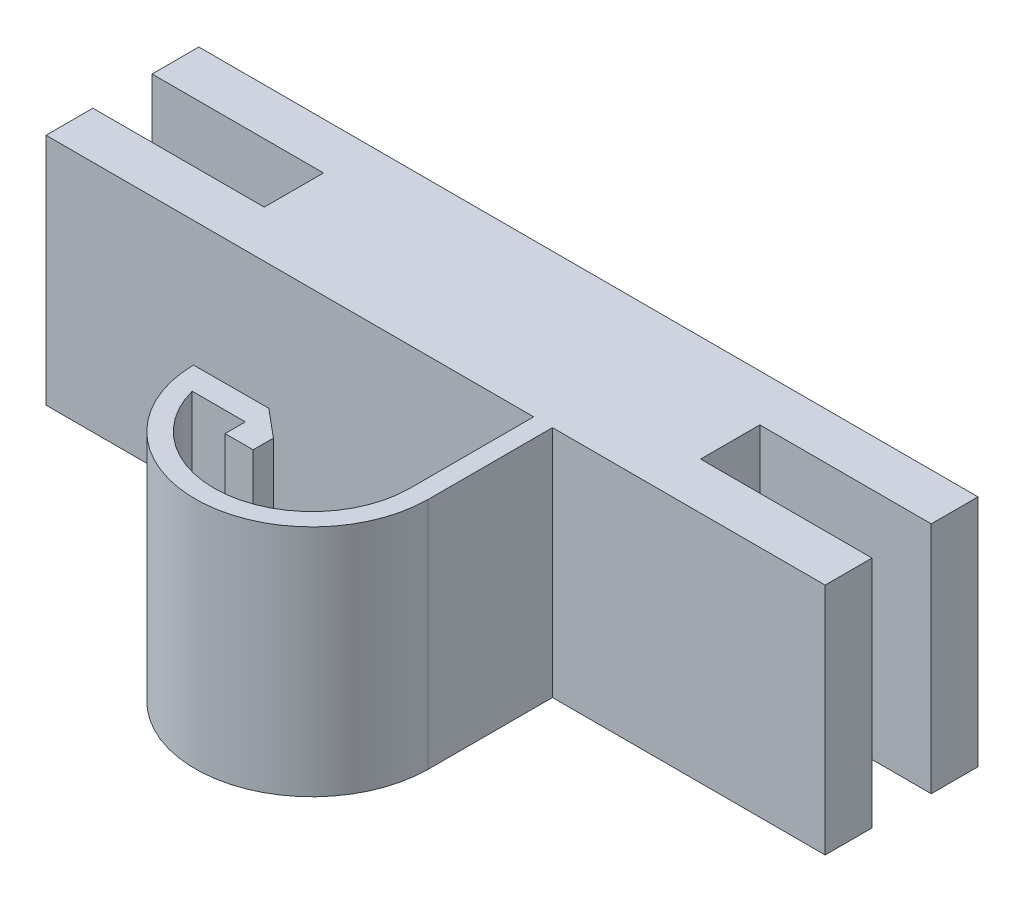
ISO-10303-21;
HEADER;
FILE_DESCRIPTION(('STEP AP214'),'2;1');
FILE_NAME('part.step','',(''),(''),'','','');
FILE_SCHEMA(('AUTOMOTIVE_DESIGN { 1 0 10303 214 1 1 1 1 }'));
ENDSEC;
DATA;
#1=APPLICATION_CONTEXT('core data for automotive mechanical design processes');
#2=APPLICATION_PROTOCOL_DEFINITION('international standard','automotive_design',2000,#1);
#3=PRODUCT_CONTEXT('',#1,'mechanical');
#4=PRODUCT('Part','Part','',(#3));
#5=PRODUCT_RELATED_PRODUCT_CATEGORY('part','',(#4));
#6=PRODUCT_DEFINITION_FORMATION('','',#4);
#7=PRODUCT_DEFINITION_CONTEXT('part definition',#1,'design');
#8=PRODUCT_DEFINITION('design','',#6,#7);
#9=PRODUCT_DEFINITION_SHAPE('','',#8);
#10=(LENGTH_UNIT() NAMED_UNIT(*) SI_UNIT(.MILLI.,.METRE.));
#11=(NAMED_UNIT(*) PLANE_ANGLE_UNIT() SI_UNIT($,.RADIAN.));
#12=(NAMED_UNIT(*) SI_UNIT($,.STERADIAN.) SOLID_ANGLE_UNIT());
#13=UNCERTAINTY_MEASURE_WITH_UNIT(LENGTH_MEASURE(1.E-05),#10,'distance_accuracy_value','');
#14=(GEOMETRIC_REPRESENTATION_CONTEXT(3) GLOBAL_UNCERTAINTY_ASSIGNED_CONTEXT((#13)) GLOBAL_UNIT_ASSIGNED_CONTEXT((#10,
#11,#12)) REPRESENTATION_CONTEXT('',''));
#15=CARTESIAN_POINT('',(0.,0.,0.));
#16=DIRECTION('',(0.,0.,1.));
#17=DIRECTION('',(1.,0.,0.));
#18=AXIS2_PLACEMENT_3D('',#15,#16,#17);
#19=CARTESIAN_POINT('',(-28.3494946045054,15.,-28.7641366865449));
#20=DIRECTION('',(1.,0.,0.));
#21=DIRECTION('',(0.,0.,-1.));
#22=AXIS2_PLACEMENT_3D('',#19,#20,#21);
#23=PLANE('',#22);
#24=DIRECTION('',(0.,0.,1.));
#25=VECTOR('',#24,1.);
#26=CARTESIAN_POINT('',(-28.3494946045054,0.,-28.7641366865449));
#27=LINE('',#26,#25);
#28=CARTESIAN_POINT('',(-28.3494946045054,0.,-28.7641366865449));
#29=VERTEX_POINT('',#28);
#30=CARTESIAN_POINT('',(-28.3494946045054,0.,-25.7641366865449));
#31=VERTEX_POINT('',#30);
#32=EDGE_CURVE('E219',#29,#31,#27,.T.);
#33=ORIENTED_EDGE('',*,*,#32,.T.);
#34=DIRECTION('',(0.,-1.,0.));
#35=VECTOR('',#34,1.);
#36=CARTESIAN_POINT('',(-28.3494946045054,15.,-25.7641366865449));
#37=LINE('',#36,#35);
#38=CARTESIAN_POINT('',(-28.3494946045054,15.,-25.7641366865449));
#39=VERTEX_POINT('',#38);
#40=EDGE_CURVE('E11',#39,#31,#37,.T.);
#41=ORIENTED_EDGE('',*,*,#40,.F.);
#42=DIRECTION('',(0.,0.,1.));
#43=VECTOR('',#42,1.);
#44=CARTESIAN_POINT('',(-28.3494946045054,15.,-28.7641366865449));
#45=LINE('',#44,#43);
#46=CARTESIAN_POINT('',(-28.3494946045054,15.,-28.7641366865449));
#47=VERTEX_POINT('',#46);
#48=EDGE_CURVE('E263',#47,#39,#45,.T.);
#49=ORIENTED_EDGE('',*,*,#48,.F.);
#50=DIRECTION('',(0.,-1.,0.));
#51=VECTOR('',#50,1.);
#52=CARTESIAN_POINT('',(-28.3494946045054,15.,-28.7641366865449));
#53=LINE('',#52,#51);
#54=EDGE_CURVE('E215',#47,#29,#53,.T.);
#55=ORIENTED_EDGE('',*,*,#54,.T.);
#56=EDGE_LOOP('',(#33,#41,#49,#55));
#57=FACE_BOUND('',#56,.T.);
#58=ADVANCED_FACE('F33',(#57),#23,.F.);
#59=CARTESIAN_POINT('',(-28.3494946045054,15.,-25.7641366865449));
#60=DIRECTION('',(0.,0.,-1.));
#61=DIRECTION('',(-1.,0.,0.));
#62=AXIS2_PLACEMENT_3D('',#59,#60,#61);
#63=PLANE('',#62);
#64=DIRECTION('',(1.,0.,0.));
#65=VECTOR('',#64,1.);
#66=CARTESIAN_POINT('',(-28.3494946045054,0.,-25.7641366865449));
#67=LINE('',#66,#65);
#68=CARTESIAN_POINT('',(-17.3494946045054,0.,-25.7641366865449));
#69=VERTEX_POINT('',#68);
#70=EDGE_CURVE('E222',#31,#69,#67,.T.);
#71=ORIENTED_EDGE('',*,*,#70,.T.);
#72=DIRECTION('',(0.,-1.,0.));
#73=VECTOR('',#72,1.);
#74=CARTESIAN_POINT('',(-17.3494946045054,15.,-25.7641366865449));
#75=LINE('',#74,#73);
#76=CARTESIAN_POINT('',(-17.3494946045054,15.,-25.7641366865449));
#77=VERTEX_POINT('',#76);
#78=EDGE_CURVE('E41',#77,#69,#75,.T.);
#79=ORIENTED_EDGE('',*,*,#78,.F.);
#80=DIRECTION('',(1.,0.,0.));
#81=VECTOR('',#80,1.);
#82=CARTESIAN_POINT('',(-28.3494946045054,15.,-25.7641366865449));
#83=LINE('',#82,#81);
#84=EDGE_CURVE('E137',#39,#77,#83,.T.);
#85=ORIENTED_EDGE('',*,*,#84,.F.);
#86=ORIENTED_EDGE('',*,*,#40,.T.);
#87=EDGE_LOOP('',(#71,#79,#85,#86));
#88=FACE_BOUND('',#87,.T.);
#89=ADVANCED_FACE('F396',(#88),#63,.F.);
#90=CARTESIAN_POINT('',(-17.3494946045054,15.,-25.7641366865449));
#91=DIRECTION('',(1.,0.,0.));
#92=DIRECTION('',(0.,0.,-1.));
#93=AXIS2_PLACEMENT_3D('',#90,#91,#92);
#94=PLANE('',#93);
#95=DIRECTION('',(0.,0.,1.));
#96=VECTOR('',#95,1.);
#97=CARTESIAN_POINT('',(-17.3494946045054,0.,-25.7641366865449));
#98=LINE('',#97,#96);
#99=CARTESIAN_POINT('',(-17.3494946045054,0.,-21.9641366865449));
#100=VERTEX_POINT('',#99);
#101=EDGE_CURVE('E224',#69,#100,#98,.T.);
#102=ORIENTED_EDGE('',*,*,#101,.T.);
#103=DIRECTION('',(0.,-1.,0.));
#104=VECTOR('',#103,1.);
#105=CARTESIAN_POINT('',(-17.3494946045054,15.,-21.9641366865449));
#106=LINE('',#105,#104);
#107=CARTESIAN_POINT('',(-17.3494946045054,15.,-21.9641366865449));
#108=VERTEX_POINT('',#107);
#109=EDGE_CURVE('E315',#108,#100,#106,.T.);
#110=ORIENTED_EDGE('',*,*,#109,.F.);
#111=DIRECTION('',(0.,0.,1.));
#112=VECTOR('',#111,1.);
#113=CARTESIAN_POINT('',(-17.3494946045054,15.,-25.7641366865449));
#114=LINE('',#113,#112);
#115=EDGE_CURVE('E323',#77,#108,#114,.T.);
#116=ORIENTED_EDGE('',*,*,#115,.F.);
#117=ORIENTED_EDGE('',*,*,#78,.T.);
#118=EDGE_LOOP('',(#102,#110,#116,#117));
#119=FACE_BOUND('',#118,.T.);
#120=ADVANCED_FACE('F321',(#119),#94,.F.);
#121=CARTESIAN_POINT('',(-28.3494946045054,15.,-21.9641366865449));
#122=DIRECTION('',(0.,0.,1.));
#123=DIRECTION('',(1.,0.,0.));
#124=AXIS2_PLACEMENT_3D('',#121,#122,#123);
#125=PLANE('',#124);
#126=DIRECTION('',(-1.,0.,0.));
#127=VECTOR('',#126,1.);
#128=CARTESIAN_POINT('',(-28.3494946045054,0.,-21.9641366865449));
#129=LINE('',#128,#127);
#130=CARTESIAN_POINT('',(-28.3494946045054,0.,-21.9641366865449));
#131=VERTEX_POINT('',#130);
#132=EDGE_CURVE('E226',#100,#131,#129,.T.);
#133=ORIENTED_EDGE('',*,*,#132,.T.);
#134=DIRECTION('',(0.,-1.,0.));
#135=VECTOR('',#134,1.);
#136=CARTESIAN_POINT('',(-28.3494946045054,15.,-21.9641366865449));
#137=LINE('',#136,#135);
#138=CARTESIAN_POINT('',(-28.3494946045054,15.,-21.9641366865449));
#139=VERTEX_POINT('',#138);
#140=EDGE_CURVE('E312',#139,#131,#137,.T.);
#141=ORIENTED_EDGE('',*,*,#140,.F.);
#142=DIRECTION('',(-1.,0.,0.));
#143=VECTOR('',#142,1.);
#144=CARTESIAN_POINT('',(-28.3494946045054,15.,-21.9641366865449));
#145=LINE('',#144,#143);
#146=EDGE_CURVE('E341',#108,#139,#145,.T.);
#147=ORIENTED_EDGE('',*,*,#146,.F.);
#148=ORIENTED_EDGE('',*,*,#109,.T.);
#149=EDGE_LOOP('',(#133,#141,#147,#148));
#150=FACE_BOUND('',#149,.T.);
#151=ADVANCED_FACE('F332',(#150),#125,.F.);
#152=CARTESIAN_POINT('',(-28.3494946045054,15.,-21.9641366865449));
#153=DIRECTION('',(1.,0.,0.));
#154=DIRECTION('',(0.,0.,-1.));
#155=AXIS2_PLACEMENT_3D('',#152,#153,#154);
#156=PLANE('',#155);
#157=DIRECTION('',(0.,0.,1.));
#158=VECTOR('',#157,1.);
#159=CARTESIAN_POINT('',(-28.3494946045054,0.,-21.9641366865449));
#160=LINE('',#159,#158);
#161=CARTESIAN_POINT('',(-28.3494946045054,0.,-18.957031621231));
#162=VERTEX_POINT('',#161);
#163=EDGE_CURVE('E228',#131,#162,#160,.T.);
#164=ORIENTED_EDGE('',*,*,#163,.T.);
#165=DIRECTION('',(0.,-1.,0.));
#166=VECTOR('',#165,1.);
#167=CARTESIAN_POINT('',(-28.3494946045054,15.,-18.957031621231));
#168=LINE('',#167,#166);
#169=CARTESIAN_POINT('',(-28.3494946045054,15.,-18.957031621231));
#170=VERTEX_POINT('',#169);
#171=EDGE_CURVE('E309',#170,#162,#168,.T.);
#172=ORIENTED_EDGE('',*,*,#171,.F.);
#173=DIRECTION('',(0.,0.,1.));
#174=VECTOR('',#173,1.);
#175=CARTESIAN_POINT('',(-28.3494946045054,15.,-21.9641366865449));
#176=LINE('',#175,#174);
#177=EDGE_CURVE('E338',#139,#170,#176,.T.);
#178=ORIENTED_EDGE('',*,*,#177,.F.);
#179=ORIENTED_EDGE('',*,*,#140,.T.);
#180=EDGE_LOOP('',(#164,#172,#178,#179));
#181=FACE_BOUND('',#180,.T.);
#182=ADVANCED_FACE('F336',(#181),#156,.F.);
#183=CARTESIAN_POINT('',(-28.3494946045054,15.,-18.957031621231));
#184=DIRECTION('',(0.,0.,-1.));
#185=DIRECTION('',(-1.,0.,0.));
#186=AXIS2_PLACEMENT_3D('',#183,#184,#185);
#187=PLANE('',#186);
#188=DIRECTION('',(1.,0.,0.));
#189=VECTOR('',#188,1.);
#190=CARTESIAN_POINT('',(-28.3494946045054,0.,-18.957031621231));
#191=LINE('',#190,#189);
#192=CARTESIAN_POINT('',(2.94781302884944,0.,-18.957031621231));
#193=VERTEX_POINT('',#192);
#194=EDGE_CURVE('E230',#162,#193,#191,.T.);
#195=ORIENTED_EDGE('',*,*,#194,.T.);
#196=DIRECTION('',(0.,-1.,0.));
#197=VECTOR('',#196,1.);
#198=CARTESIAN_POINT('',(2.94781302884944,15.,-18.957031621231));
#199=LINE('',#198,#197);
#200=CARTESIAN_POINT('',(2.94781302884944,15.,-18.957031621231));
#201=VERTEX_POINT('',#200);
#202=EDGE_CURVE('E306',#201,#193,#199,.T.);
#203=ORIENTED_EDGE('',*,*,#202,.F.);
#204=DIRECTION('',(1.,0.,0.));
#205=VECTOR('',#204,1.);
#206=CARTESIAN_POINT('',(-28.3494946045054,15.,-18.957031621231));
#207=LINE('',#206,#205);
#208=EDGE_CURVE('E340',#170,#201,#207,.T.);
#209=ORIENTED_EDGE('',*,*,#208,.F.);
#210=ORIENTED_EDGE('',*,*,#171,.T.);
#211=EDGE_LOOP('',(#195,#203,#209,#210));
#212=FACE_BOUND('',#211,.T.);
#213=ADVANCED_FACE('F409',(#212),#187,.F.);
#214=CARTESIAN_POINT('',(2.94781302884944,15.,-10.957031621231));
#215=DIRECTION('',(1.,0.,0.));
#216=DIRECTION('',(0.,0.,-1.));
#217=AXIS2_PLACEMENT_3D('',#214,#215,#216);
#218=PLANE('',#217);
#219=DIRECTION('',(0.,0.,1.));
#220=VECTOR('',#219,1.);
#221=CARTESIAN_POINT('',(2.94781302884944,0.,-10.957031621231));
#222=LINE('',#221,#220);
#223=CARTESIAN_POINT('',(2.94781302884944,0.,-10.957031621231));
#224=VERTEX_POINT('',#223);
#225=EDGE_CURVE('E232',#193,#224,#222,.T.);
#226=ORIENTED_EDGE('',*,*,#225,.T.);
#227=DIRECTION('',(0.,-1.,0.));
#228=VECTOR('',#227,1.);
#229=CARTESIAN_POINT('',(2.94781302884944,15.,-10.957031621231));
#230=LINE('',#229,#228);
#231=CARTESIAN_POINT('',(2.94781302884944,15.,-10.957031621231));
#232=VERTEX_POINT('',#231);
#233=EDGE_CURVE('E303',#232,#224,#230,.T.);
#234=ORIENTED_EDGE('',*,*,#233,.F.);
#235=DIRECTION('',(0.,0.,1.));
#236=VECTOR('',#235,1.);
#237=CARTESIAN_POINT('',(2.94781302884944,15.,-10.957031621231));
#238=LINE('',#237,#236);
#239=EDGE_CURVE('E343',#201,#232,#238,.T.);
#240=ORIENTED_EDGE('',*,*,#239,.F.);
#241=ORIENTED_EDGE('',*,*,#202,.T.);
#242=EDGE_LOOP('',(#226,#234,#240,#241));
#243=FACE_BOUND('',#242,.T.);
#244=ADVANCED_FACE('F412',(#243),#218,.F.);
#245=CARTESIAN_POINT('',(-3.34884776816842,15.,-11.0291567802373));
#246=DIRECTION('',(0.,-1.,0.));
#247=DIRECTION('',(0.,0.,-1.));
#248=AXIS2_PLACEMENT_3D('',#245,#246,#247);
#249=CYLINDRICAL_SURFACE('',#248,6.29707386261772);
#250=CARTESIAN_POINT('',(-3.34884776816842,0.,-11.0291567802373));
#251=DIRECTION('',(0.,-1.,0.));
#252=DIRECTION('',(0.,0.,1.));
#253=AXIS2_PLACEMENT_3D('',#250,#251,#252);
#254=CIRCLE('',#253,6.29707386261772);
#255=CARTESIAN_POINT('',(-9.43771436646013,0.,-9.42327920723522));
#256=VERTEX_POINT('',#255);
#257=EDGE_CURVE('E234',#224,#256,#254,.T.);
#258=ORIENTED_EDGE('',*,*,#257,.T.);
#259=DIRECTION('',(0.,-1.,0.));
#260=VECTOR('',#259,1.);
#261=CARTESIAN_POINT('',(-9.43771436646013,15.,-9.42327920723522));
#262=LINE('',#261,#260);
#263=CARTESIAN_POINT('',(-9.43771436646013,15.,-9.42327920723522));
#264=VERTEX_POINT('',#263);
#265=EDGE_CURVE('E300',#264,#256,#262,.T.);
#266=ORIENTED_EDGE('',*,*,#265,.F.);
#267=CARTESIAN_POINT('',(-3.34884776816842,15.,-11.0291567802373));
#268=DIRECTION('',(0.,-1.,0.));
#269=DIRECTION('',(0.,0.,1.));
#270=AXIS2_PLACEMENT_3D('',#267,#268,#269);
#271=CIRCLE('',#270,6.29707386261772);
#272=EDGE_CURVE('E349',#232,#264,#271,.T.);
#273=ORIENTED_EDGE('',*,*,#272,.F.);
#274=ORIENTED_EDGE('',*,*,#233,.T.);
#275=EDGE_LOOP('',(#258,#266,#273,#274));
#276=FACE_BOUND('',#275,.T.);
#277=ADVANCED_FACE('F416',(#276),#249,.F.);
#278=CARTESIAN_POINT('',(-6.02598002729304,15.,-9.42327920723522));
#279=DIRECTION('',(0.,0.,-1.));
#280=DIRECTION('',(-1.,0.,0.));
#281=AXIS2_PLACEMENT_3D('',#278,#279,#280);
#282=PLANE('',#281);
#283=DIRECTION('',(1.,0.,0.));
#284=VECTOR('',#283,1.);
#285=CARTESIAN_POINT('',(-6.02598002729304,0.,-9.42327920723522));
#286=LINE('',#285,#284);
#287=CARTESIAN_POINT('',(-6.02598002729304,0.,-9.42327920723522));
#288=VERTEX_POINT('',#287);
#289=EDGE_CURVE('E236',#256,#288,#286,.T.);
#290=ORIENTED_EDGE('',*,*,#289,.T.);
#291=DIRECTION('',(0.,-1.,0.));
#292=VECTOR('',#291,1.);
#293=CARTESIAN_POINT('',(-6.02598002729304,15.,-9.42327920723522));
#294=LINE('',#293,#292);
#295=CARTESIAN_POINT('',(-6.02598002729304,15.,-9.42327920723522));
#296=VERTEX_POINT('',#295);
#297=EDGE_CURVE('E297',#296,#288,#294,.T.);
#298=ORIENTED_EDGE('',*,*,#297,.F.);
#299=DIRECTION('',(1.,0.,0.));
#300=VECTOR('',#299,1.);
#301=CARTESIAN_POINT('',(-6.02598002729304,15.,-9.42327920723522));
#302=LINE('',#301,#300);
#303=EDGE_CURVE('E351',#264,#296,#302,.T.);
#304=ORIENTED_EDGE('',*,*,#303,.F.);
#305=ORIENTED_EDGE('',*,*,#265,.T.);
#306=EDGE_LOOP('',(#290,#298,#304,#305));
#307=FACE_BOUND('',#306,.T.);
#308=ADVANCED_FACE('F420',(#307),#282,.F.);
#309=CARTESIAN_POINT('',(-6.02598002729304,15.,-8.12221037726084));
#310=DIRECTION('',(1.,0.,0.));
#311=DIRECTION('',(0.,0.,-1.));
#312=AXIS2_PLACEMENT_3D('',#309,#310,#311);
#313=PLANE('',#312);
#314=DIRECTION('',(0.,0.,1.));
#315=VECTOR('',#314,1.);
#316=CARTESIAN_POINT('',(-6.02598002729304,0.,-8.12221037726084));
#317=LINE('',#316,#315);
#318=CARTESIAN_POINT('',(-6.02598002729304,0.,-8.12221037726084));
#319=VERTEX_POINT('',#318);
#320=EDGE_CURVE('E238',#288,#319,#317,.T.);
#321=ORIENTED_EDGE('',*,*,#320,.T.);
#322=DIRECTION('',(0.,-1.,0.));
#323=VECTOR('',#322,1.);
#324=CARTESIAN_POINT('',(-6.02598002729304,15.,-8.12221037726084));
#325=LINE('',#324,#323);
#326=CARTESIAN_POINT('',(-6.02598002729304,15.,-8.12221037726084));
#327=VERTEX_POINT('',#326);
#328=EDGE_CURVE('E294',#327,#319,#325,.T.);
#329=ORIENTED_EDGE('',*,*,#328,.F.);
#330=DIRECTION('',(0.,0.,1.));
#331=VECTOR('',#330,1.);
#332=CARTESIAN_POINT('',(-6.02598002729304,15.,-8.12221037726084));
#333=LINE('',#332,#331);
#334=EDGE_CURVE('E353',#296,#327,#333,.T.);
#335=ORIENTED_EDGE('',*,*,#334,.F.);
#336=ORIENTED_EDGE('',*,*,#297,.T.);
#337=EDGE_LOOP('',(#321,#329,#335,#336));
#338=FACE_BOUND('',#337,.T.);
#339=ADVANCED_FACE('F424',(#338),#313,.F.);
#340=CARTESIAN_POINT('',(-4.22249353495374,15.,-8.12221037726084));
#341=DIRECTION('',(0.,0.,-1.));
#342=DIRECTION('',(-1.,0.,0.));
#343=AXIS2_PLACEMENT_3D('',#340,#341,#342);
#344=PLANE('',#343);
#345=DIRECTION('',(1.,0.,0.));
#346=VECTOR('',#345,1.);
#347=CARTESIAN_POINT('',(-4.22249353495374,0.,-8.12221037726084));
#348=LINE('',#347,#346);
#349=CARTESIAN_POINT('',(-4.22249353495374,0.,-8.12221037726084));
#350=VERTEX_POINT('',#349);
#351=EDGE_CURVE('E240',#319,#350,#348,.T.);
#352=ORIENTED_EDGE('',*,*,#351,.T.);
#353=DIRECTION('',(0.,-1.,0.));
#354=VECTOR('',#353,1.);
#355=CARTESIAN_POINT('',(-4.22249353495374,15.,-8.12221037726084));
#356=LINE('',#355,#354);
#357=CARTESIAN_POINT('',(-4.22249353495374,15.,-8.12221037726084));
#358=VERTEX_POINT('',#357);
#359=EDGE_CURVE('E291',#358,#350,#356,.T.);
#360=ORIENTED_EDGE('',*,*,#359,.F.);
#361=DIRECTION('',(1.,0.,0.));
#362=VECTOR('',#361,1.);
#363=CARTESIAN_POINT('',(-4.22249353495374,15.,-8.12221037726084));
#364=LINE('',#363,#362);
#365=EDGE_CURVE('E355',#327,#358,#364,.T.);
#366=ORIENTED_EDGE('',*,*,#365,.F.);
#367=ORIENTED_EDGE('',*,*,#328,.T.);
#368=EDGE_LOOP('',(#352,#360,#366,#367));
#369=FACE_BOUND('',#368,.T.);
#370=ADVANCED_FACE('F428',(#369),#344,.F.);
#371=CARTESIAN_POINT('',(-4.22249353495374,15.,-9.42322624533869));
#372=DIRECTION('',(-1.,0.,0.));
#373=DIRECTION('',(0.,0.,1.));
#374=AXIS2_PLACEMENT_3D('',#371,#372,#373);
#375=PLANE('',#374);
#376=DIRECTION('',(0.,0.,-1.));
#377=VECTOR('',#376,1.);
#378=CARTESIAN_POINT('',(-4.22249353495374,0.,-9.42322624533869));
#379=LINE('',#378,#377);
#380=CARTESIAN_POINT('',(-4.22249353495374,0.,-9.42322624533869));
#381=VERTEX_POINT('',#380);
#382=EDGE_CURVE('E242',#350,#381,#379,.T.);
#383=ORIENTED_EDGE('',*,*,#382,.T.);
#384=DIRECTION('',(0.,-1.,0.));
#385=VECTOR('',#384,1.);
#386=CARTESIAN_POINT('',(-4.22249353495374,15.,-9.42322624533869));
#387=LINE('',#386,#385);
#388=CARTESIAN_POINT('',(-4.22249353495374,15.,-9.42322624533869));
#389=VERTEX_POINT('',#388);
#390=EDGE_CURVE('E288',#389,#381,#387,.T.);
#391=ORIENTED_EDGE('',*,*,#390,.F.);
#392=DIRECTION('',(0.,0.,-1.));
#393=VECTOR('',#392,1.);
#394=CARTESIAN_POINT('',(-4.22249353495374,15.,-9.42322624533869));
#395=LINE('',#394,#393);
#396=EDGE_CURVE('E357',#358,#389,#395,.T.);
#397=ORIENTED_EDGE('',*,*,#396,.F.);
#398=ORIENTED_EDGE('',*,*,#359,.T.);
#399=EDGE_LOOP('',(#383,#391,#397,#398));
#400=FACE_BOUND('',#399,.T.);
#401=ADVANCED_FACE('F432',(#400),#375,.F.);
#402=CARTESIAN_POINT('',(-6.02618083831885,15.,-10.9323892807032));
#403=DIRECTION('',(-0.641711450833545,0.,0.766946160997698));
#404=DIRECTION('',(0.766946160997698,0.,0.641711450833545));
#405=AXIS2_PLACEMENT_3D('',#402,#403,#404);
#406=PLANE('',#405);
#407=DIRECTION('',(-0.766946160997698,0.,-0.641711450833545));
#408=VECTOR('',#407,1.);
#409=CARTESIAN_POINT('',(-6.02618083831885,0.,-10.9323892807032));
#410=LINE('',#409,#408);
#411=CARTESIAN_POINT('',(-6.02618083831885,0.,-10.9323892807032));
#412=VERTEX_POINT('',#411);
#413=EDGE_CURVE('E244',#381,#412,#410,.T.);
#414=ORIENTED_EDGE('',*,*,#413,.T.);
#415=DIRECTION('',(0.,-1.,0.));
#416=VECTOR('',#415,1.);
#417=CARTESIAN_POINT('',(-6.02618083831885,15.,-10.9323892807032));
#418=LINE('',#417,#416);
#419=CARTESIAN_POINT('',(-6.02618083831885,15.,-10.9323892807032));
#420=VERTEX_POINT('',#419);
#421=EDGE_CURVE('E285',#420,#412,#418,.T.);
#422=ORIENTED_EDGE('',*,*,#421,.F.);
#423=DIRECTION('',(-0.766946160997698,0.,-0.641711450833545));
#424=VECTOR('',#423,1.);
#425=CARTESIAN_POINT('',(-6.02618083831885,15.,-10.9323892807032));
#426=LINE('',#425,#424);
#427=EDGE_CURVE('E359',#389,#420,#426,.T.);
#428=ORIENTED_EDGE('',*,*,#427,.F.);
#429=ORIENTED_EDGE('',*,*,#390,.T.);
#430=EDGE_LOOP('',(#414,#422,#428,#429));
#431=FACE_BOUND('',#430,.T.);
#432=ADVANCED_FACE('F436',(#431),#406,.F.);
#433=CARTESIAN_POINT('',(-10.8477142626421,15.,-10.9173479703678));
#434=DIRECTION('',(0.0031195961577817,0.,0.999995134048067));
#435=DIRECTION('',(0.999995134048068,0.,-0.0031195961577817));
#436=AXIS2_PLACEMENT_3D('',#433,#434,#435);
#437=PLANE('',#436);
#438=DIRECTION('',(-0.999995134048067,0.,0.0031195961577817));
#439=VECTOR('',#438,1.);
#440=CARTESIAN_POINT('',(-10.8477142626421,0.,-10.9173479703678));
#441=LINE('',#440,#439);
#442=CARTESIAN_POINT('',(-10.8477142626421,0.,-10.9173479703678));
#443=VERTEX_POINT('',#442);
#444=EDGE_CURVE('E246',#412,#443,#441,.T.);
#445=ORIENTED_EDGE('',*,*,#444,.T.);
#446=DIRECTION('',(0.,-1.,0.));
#447=VECTOR('',#446,1.);
#448=CARTESIAN_POINT('',(-10.8477142626421,15.,-10.9173479703678));
#449=LINE('',#448,#447);
#450=CARTESIAN_POINT('',(-10.8477142626421,15.,-10.9173479703678));
#451=VERTEX_POINT('',#450);
#452=EDGE_CURVE('E282',#451,#443,#449,.T.);
#453=ORIENTED_EDGE('',*,*,#452,.F.);
#454=DIRECTION('',(-0.999995134048067,0.,0.0031195961577817));
#455=VECTOR('',#454,1.);
#456=CARTESIAN_POINT('',(-10.8477142626421,15.,-10.9173479703678));
#457=LINE('',#456,#455);
#458=EDGE_CURVE('E361',#420,#451,#457,.T.);
#459=ORIENTED_EDGE('',*,*,#458,.F.);
#460=ORIENTED_EDGE('',*,*,#421,.T.);
#461=EDGE_LOOP('',(#445,#453,#459,#460));
#462=FACE_BOUND('',#461,.T.);
#463=ADVANCED_FACE('F440',(#462),#437,.F.);
#464=CARTESIAN_POINT('',(-3.34884776816842,15.,-11.0291567802373));
#465=DIRECTION('',(0.,-1.,0.));
#466=DIRECTION('',(0.,0.,-1.));
#467=AXIS2_PLACEMENT_3D('',#464,#465,#466);
#468=CYLINDRICAL_SURFACE('',#467,7.49969998812645);
#469=CARTESIAN_POINT('',(-3.34884776816842,0.,-11.0291567802373));
#470=DIRECTION('',(0.,1.,0.));
#471=DIRECTION('',(0.,0.,1.));
#472=AXIS2_PLACEMENT_3D('',#469,#470,#471);
#473=CIRCLE('',#472,7.49969998812645);
#474=CARTESIAN_POINT('',(4.15050539549457,0.,-10.957031621231));
#475=VERTEX_POINT('',#474);
#476=EDGE_CURVE('E248',#443,#475,#473,.T.);
#477=ORIENTED_EDGE('',*,*,#476,.T.);
#478=DIRECTION('',(0.,-1.,0.));
#479=VECTOR('',#478,1.);
#480=CARTESIAN_POINT('',(4.15050539549457,15.,-10.957031621231));
#481=LINE('',#480,#479);
#482=CARTESIAN_POINT('',(4.15050539549457,15.,-10.957031621231));
#483=VERTEX_POINT('',#482);
#484=EDGE_CURVE('E279',#483,#475,#481,.T.);
#485=ORIENTED_EDGE('',*,*,#484,.F.);
#486=CARTESIAN_POINT('',(-3.34884776816842,15.,-11.0291567802373));
#487=DIRECTION('',(0.,1.,0.));
#488=DIRECTION('',(0.,0.,1.));
#489=AXIS2_PLACEMENT_3D('',#486,#487,#488);
#490=CIRCLE('',#489,7.49969998812645);
#491=EDGE_CURVE('E363',#451,#483,#490,.T.);
#492=ORIENTED_EDGE('',*,*,#491,.F.);
#493=ORIENTED_EDGE('',*,*,#452,.T.);
#494=EDGE_LOOP('',(#477,#485,#492,#493));
#495=FACE_BOUND('',#494,.T.);
#496=ADVANCED_FACE('F444',(#495),#468,.T.);
#497=CARTESIAN_POINT('',(4.15050539549457,15.,-18.957031621231));
#498=DIRECTION('',(-1.,0.,0.));
#499=DIRECTION('',(0.,0.,1.));
#500=AXIS2_PLACEMENT_3D('',#497,#498,#499);
#501=PLANE('',#500);
#502=DIRECTION('',(0.,0.,-1.));
#503=VECTOR('',#502,1.);
#504=CARTESIAN_POINT('',(4.15050539549457,0.,-18.957031621231));
#505=LINE('',#504,#503);
#506=CARTESIAN_POINT('',(4.15050539549457,0.,-18.957031621231));
#507=VERTEX_POINT('',#506);
#508=EDGE_CURVE('E250',#475,#507,#505,.T.);
#509=ORIENTED_EDGE('',*,*,#508,.T.);
#510=DIRECTION('',(0.,-1.,0.));
#511=VECTOR('',#510,1.);
#512=CARTESIAN_POINT('',(4.15050539549457,15.,-18.957031621231));
#513=LINE('',#512,#511);
#514=CARTESIAN_POINT('',(4.15050539549457,15.,-18.957031621231));
#515=VERTEX_POINT('',#514);
#516=EDGE_CURVE('E276',#515,#507,#513,.T.);
#517=ORIENTED_EDGE('',*,*,#516,.F.);
#518=DIRECTION('',(0.,0.,-1.));
#519=VECTOR('',#518,1.);
#520=CARTESIAN_POINT('',(4.15050539549457,15.,-18.957031621231));
#521=LINE('',#520,#519);
#522=EDGE_CURVE('E365',#483,#515,#521,.T.);
#523=ORIENTED_EDGE('',*,*,#522,.F.);
#524=ORIENTED_EDGE('',*,*,#484,.T.);
#525=EDGE_LOOP('',(#509,#517,#523,#524));
#526=FACE_BOUND('',#525,.T.);
#527=ADVANCED_FACE('F448',(#526),#501,.F.);
#528=CARTESIAN_POINT('',(4.15050539549457,15.,-18.957031621231));
#529=DIRECTION('',(0.,0.,-1.));
#530=DIRECTION('',(-1.,0.,0.));
#531=AXIS2_PLACEMENT_3D('',#528,#529,#530);
#532=PLANE('',#531);
#533=DIRECTION('',(1.,0.,0.));
#534=VECTOR('',#533,1.);
#535=CARTESIAN_POINT('',(4.15050539549457,0.,-18.957031621231));
#536=LINE('',#535,#534);
#537=CARTESIAN_POINT('',(21.6505053954946,0.,-18.957031621231));
#538=VERTEX_POINT('',#537);
#539=EDGE_CURVE('E252',#507,#538,#536,.T.);
#540=ORIENTED_EDGE('',*,*,#539,.T.);
#541=DIRECTION('',(0.,-1.,0.));
#542=VECTOR('',#541,1.);
#543=CARTESIAN_POINT('',(21.6505053954946,15.,-18.957031621231));
#544=LINE('',#543,#542);
#545=CARTESIAN_POINT('',(21.6505053954946,15.,-18.957031621231));
#546=VERTEX_POINT('',#545);
#547=EDGE_CURVE('E273',#546,#538,#544,.T.);
#548=ORIENTED_EDGE('',*,*,#547,.F.);
#549=DIRECTION('',(1.,0.,0.));
#550=VECTOR('',#549,1.);
#551=CARTESIAN_POINT('',(4.15050539549457,15.,-18.957031621231));
#552=LINE('',#551,#550);
#553=EDGE_CURVE('E367',#515,#546,#552,.T.);
#554=ORIENTED_EDGE('',*,*,#553,.F.);
#555=ORIENTED_EDGE('',*,*,#516,.T.);
#556=EDGE_LOOP('',(#540,#548,#554,#555));
#557=FACE_BOUND('',#556,.T.);
#558=ADVANCED_FACE('F452',(#557),#532,.F.);
#559=CARTESIAN_POINT('',(21.6505053954946,15.,-21.9641366865449));
#560=DIRECTION('',(-1.,0.,0.));
#561=DIRECTION('',(0.,0.,1.));
#562=AXIS2_PLACEMENT_3D('',#559,#560,#561);
#563=PLANE('',#562);
#564=DIRECTION('',(0.,0.,-1.));
#565=VECTOR('',#564,1.);
#566=CARTESIAN_POINT('',(21.6505053954946,0.,-21.9641366865449));
#567=LINE('',#566,#565);
#568=CARTESIAN_POINT('',(21.6505053954946,0.,-21.9641366865449));
#569=VERTEX_POINT('',#568);
#570=EDGE_CURVE('E254',#538,#569,#567,.T.);
#571=ORIENTED_EDGE('',*,*,#570,.T.);
#572=DIRECTION('',(0.,-1.,0.));
#573=VECTOR('',#572,1.);
#574=CARTESIAN_POINT('',(21.6505053954946,15.,-21.9641366865449));
#575=LINE('',#574,#573);
#576=CARTESIAN_POINT('',(21.6505053954946,15.,-21.9641366865449));
#577=VERTEX_POINT('',#576);
#578=EDGE_CURVE('E270',#577,#569,#575,.T.);
#579=ORIENTED_EDGE('',*,*,#578,.F.);
#580=DIRECTION('',(0.,0.,-1.));
#581=VECTOR('',#580,1.);
#582=CARTESIAN_POINT('',(21.6505053954946,15.,-21.9641366865449));
#583=LINE('',#582,#581);
#584=EDGE_CURVE('E369',#546,#577,#583,.T.);
#585=ORIENTED_EDGE('',*,*,#584,.F.);
#586=ORIENTED_EDGE('',*,*,#547,.T.);
#587=EDGE_LOOP('',(#571,#579,#585,#586));
#588=FACE_BOUND('',#587,.T.);
#589=ADVANCED_FACE('F456',(#588),#563,.F.);
#590=CARTESIAN_POINT('',(10.6505053954946,15.,-21.9641366865449));
#591=DIRECTION('',(0.,0.,1.));
#592=DIRECTION('',(1.,0.,0.));
#593=AXIS2_PLACEMENT_3D('',#590,#591,#592);
#594=PLANE('',#593);
#595=DIRECTION('',(-1.,0.,0.));
#596=VECTOR('',#595,1.);
#597=CARTESIAN_POINT('',(10.6505053954946,0.,-21.9641366865449));
#598=LINE('',#597,#596);
#599=CARTESIAN_POINT('',(10.6505053954946,0.,-21.9641366865449));
#600=VERTEX_POINT('',#599);
#601=EDGE_CURVE('E256',#569,#600,#598,.T.);
#602=ORIENTED_EDGE('',*,*,#601,.T.);
#603=DIRECTION('',(0.,-1.,0.));
#604=VECTOR('',#603,1.);
#605=CARTESIAN_POINT('',(10.6505053954946,15.,-21.9641366865449));
#606=LINE('',#605,#604);
#607=CARTESIAN_POINT('',(10.6505053954946,15.,-21.9641366865449));
#608=VERTEX_POINT('',#607);
#609=EDGE_CURVE('E267',#608,#600,#606,.T.);
#610=ORIENTED_EDGE('',*,*,#609,.F.);
#611=DIRECTION('',(-1.,0.,0.));
#612=VECTOR('',#611,1.);
#613=CARTESIAN_POINT('',(10.6505053954946,15.,-21.9641366865449));
#614=LINE('',#613,#612);
#615=EDGE_CURVE('E371',#577,#608,#614,.T.);
#616=ORIENTED_EDGE('',*,*,#615,.F.);
#617=ORIENTED_EDGE('',*,*,#578,.T.);
#618=EDGE_LOOP('',(#602,#610,#616,#617));
#619=FACE_BOUND('',#618,.T.);
#620=ADVANCED_FACE('F377',(#619),#594,.F.);
#621=CARTESIAN_POINT('',(10.6505053954946,15.,-25.7641366865449));
#622=DIRECTION('',(-1.,0.,0.));
#623=DIRECTION('',(0.,0.,1.));
#624=AXIS2_PLACEMENT_3D('',#621,#622,#623);
#625=PLANE('',#624);
#626=DIRECTION('',(0.,0.,-1.));
#627=VECTOR('',#626,1.);
#628=CARTESIAN_POINT('',(10.6505053954946,0.,-25.7641366865449));
#629=LINE('',#628,#627);
#630=CARTESIAN_POINT('',(10.6505053954946,0.,-25.7641366865449));
#631=VERTEX_POINT('',#630);
#632=EDGE_CURVE('E258',#600,#631,#629,.T.);
#633=ORIENTED_EDGE('',*,*,#632,.T.);
#634=DIRECTION('',(0.,-1.,0.));
#635=VECTOR('',#634,1.);
#636=CARTESIAN_POINT('',(10.6505053954946,15.,-25.7641366865449));
#637=LINE('',#636,#635);
#638=CARTESIAN_POINT('',(10.6505053954946,15.,-25.7641366865449));
#639=VERTEX_POINT('',#638);
#640=EDGE_CURVE('E210',#639,#631,#637,.T.);
#641=ORIENTED_EDGE('',*,*,#640,.F.);
#642=DIRECTION('',(0.,0.,-1.));
#643=VECTOR('',#642,1.);
#644=CARTESIAN_POINT('',(10.6505053954946,15.,-25.7641366865449));
#645=LINE('',#644,#643);
#646=EDGE_CURVE('E201',#608,#639,#645,.T.);
#647=ORIENTED_EDGE('',*,*,#646,.F.);
#648=ORIENTED_EDGE('',*,*,#609,.T.);
#649=EDGE_LOOP('',(#633,#641,#647,#648));
#650=FACE_BOUND('',#649,.T.);
#651=ADVANCED_FACE('F381',(#650),#625,.F.);
#652=CARTESIAN_POINT('',(10.6505053954946,15.,-25.7641366865449));
#653=DIRECTION('',(0.,0.,-1.));
#654=DIRECTION('',(-1.,0.,0.));
#655=AXIS2_PLACEMENT_3D('',#652,#653,#654);
#656=PLANE('',#655);
#657=DIRECTION('',(1.,0.,0.));
#658=VECTOR('',#657,1.);
#659=CARTESIAN_POINT('',(10.6505053954946,0.,-25.7641366865449));
#660=LINE('',#659,#658);
#661=CARTESIAN_POINT('',(21.6505053954946,0.,-25.7641366865449));
#662=VERTEX_POINT('',#661);
#663=EDGE_CURVE('E209',#631,#662,#660,.T.);
#664=ORIENTED_EDGE('',*,*,#663,.T.);
#665=DIRECTION('',(0.,-1.,0.));
#666=VECTOR('',#665,1.);
#667=CARTESIAN_POINT('',(21.6505053954946,15.,-25.7641366865449));
#668=LINE('',#667,#666);
#669=CARTESIAN_POINT('',(21.6505053954946,15.,-25.7641366865449));
#670=VERTEX_POINT('',#669);
#671=EDGE_CURVE('E206',#670,#662,#668,.T.);
#672=ORIENTED_EDGE('',*,*,#671,.F.);
#673=DIRECTION('',(1.,0.,0.));
#674=VECTOR('',#673,1.);
#675=CARTESIAN_POINT('',(10.6505053954946,15.,-25.7641366865449));
#676=LINE('',#675,#674);
#677=EDGE_CURVE('E195',#639,#670,#676,.T.);
#678=ORIENTED_EDGE('',*,*,#677,.F.);
#679=ORIENTED_EDGE('',*,*,#640,.T.);
#680=EDGE_LOOP('',(#664,#672,#678,#679));
#681=FACE_BOUND('',#680,.T.);
#682=ADVANCED_FACE('F207',(#681),#656,.F.);
#683=CARTESIAN_POINT('',(21.6505053954946,15.,-28.7641366865449));
#684=DIRECTION('',(-1.,0.,0.));
#685=DIRECTION('',(0.,0.,1.));
#686=AXIS2_PLACEMENT_3D('',#683,#684,#685);
#687=PLANE('',#686);
#688=DIRECTION('',(0.,0.,-1.));
#689=VECTOR('',#688,1.);
#690=CARTESIAN_POINT('',(21.6505053954946,0.,-28.7641366865449));
#691=LINE('',#690,#689);
#692=CARTESIAN_POINT('',(21.6505053954946,0.,-28.7641366865449));
#693=VERTEX_POINT('',#692);
#694=EDGE_CURVE('E123',#662,#693,#691,.T.);
#695=ORIENTED_EDGE('',*,*,#694,.T.);
#696=DIRECTION('',(0.,-1.,0.));
#697=VECTOR('',#696,1.);
#698=CARTESIAN_POINT('',(21.6505053954946,15.,-28.7641366865449));
#699=LINE('',#698,#697);
#700=CARTESIAN_POINT('',(21.6505053954946,15.,-28.7641366865449));
#701=VERTEX_POINT('',#700);
#702=EDGE_CURVE('E211',#701,#693,#699,.T.);
#703=ORIENTED_EDGE('',*,*,#702,.F.);
#704=DIRECTION('',(0.,0.,-1.));
#705=VECTOR('',#704,1.);
#706=CARTESIAN_POINT('',(21.6505053954946,15.,-28.7641366865449));
#707=LINE('',#706,#705);
#708=EDGE_CURVE('E199',#670,#701,#707,.T.);
#709=ORIENTED_EDGE('',*,*,#708,.F.);
#710=ORIENTED_EDGE('',*,*,#671,.T.);
#711=EDGE_LOOP('',(#695,#703,#709,#710));
#712=FACE_BOUND('',#711,.T.);
#713=ADVANCED_FACE('F213',(#712),#687,.F.);
#714=CARTESIAN_POINT('',(-28.3494946045054,15.,-28.7641366865449));
#715=DIRECTION('',(0.,0.,1.));
#716=DIRECTION('',(1.,0.,0.));
#717=AXIS2_PLACEMENT_3D('',#714,#715,#716);
#718=PLANE('',#717);
#719=DIRECTION('',(-1.,0.,0.));
#720=VECTOR('',#719,1.);
#721=CARTESIAN_POINT('',(-28.3494946045054,0.,-28.7641366865449));
#722=LINE('',#721,#720);
#723=EDGE_CURVE('E129',#693,#29,#722,.T.);
#724=ORIENTED_EDGE('',*,*,#723,.T.);
#725=ORIENTED_EDGE('',*,*,#54,.F.);
#726=DIRECTION('',(-1.,0.,0.));
#727=VECTOR('',#726,1.);
#728=CARTESIAN_POINT('',(-28.3494946045054,15.,-28.7641366865449));
#729=LINE('',#728,#727);
#730=EDGE_CURVE('E49',#701,#47,#729,.T.);
#731=ORIENTED_EDGE('',*,*,#730,.F.);
#732=ORIENTED_EDGE('',*,*,#702,.T.);
#733=EDGE_LOOP('',(#724,#725,#731,#732));
#734=FACE_BOUND('',#733,.T.);
#735=ADVANCED_FACE('F385',(#734),#718,.F.);
#736=CARTESIAN_POINT('',(-3.34884776816842,15.,-11.0291567802373));
#737=DIRECTION('',(0.,1.,0.));
#738=DIRECTION('',(0.,0.,1.));
#739=AXIS2_PLACEMENT_3D('',#736,#737,#738);
#740=PLANE('',#739);
#741=ORIENTED_EDGE('',*,*,#48,.T.);
#742=ORIENTED_EDGE('',*,*,#84,.T.);
#743=ORIENTED_EDGE('',*,*,#115,.T.);
#744=ORIENTED_EDGE('',*,*,#146,.T.);
#745=ORIENTED_EDGE('',*,*,#177,.T.);
#746=ORIENTED_EDGE('',*,*,#208,.T.);
#747=ORIENTED_EDGE('',*,*,#239,.T.);
#748=ORIENTED_EDGE('',*,*,#272,.T.);
#749=ORIENTED_EDGE('',*,*,#303,.T.);
#750=ORIENTED_EDGE('',*,*,#334,.T.);
#751=ORIENTED_EDGE('',*,*,#365,.T.);
#752=ORIENTED_EDGE('',*,*,#396,.T.);
#753=ORIENTED_EDGE('',*,*,#427,.T.);
#754=ORIENTED_EDGE('',*,*,#458,.T.);
#755=ORIENTED_EDGE('',*,*,#491,.T.);
#756=ORIENTED_EDGE('',*,*,#522,.T.);
#757=ORIENTED_EDGE('',*,*,#553,.T.);
#758=ORIENTED_EDGE('',*,*,#584,.T.);
#759=ORIENTED_EDGE('',*,*,#615,.T.);
#760=ORIENTED_EDGE('',*,*,#646,.T.);
#761=ORIENTED_EDGE('',*,*,#677,.T.);
#762=ORIENTED_EDGE('',*,*,#708,.T.);
#763=ORIENTED_EDGE('',*,*,#730,.T.);
#764=EDGE_LOOP('',(#741,#742,#743,#744,#745,#746,#747,#748,#749,#750,#751,#752,#753,#754,#755,
#756,#757,#758,#759,#760,#761,#762,#763));
#765=FACE_BOUND('',#764,.T.);
#766=ADVANCED_FACE('F197',(#765),#740,.T.);
#767=CARTESIAN_POINT('',(-3.34884776816842,0.,-11.0291567802373));
#768=DIRECTION('',(0.,1.,0.));
#769=DIRECTION('',(0.,0.,1.));
#770=AXIS2_PLACEMENT_3D('',#767,#768,#769);
#771=PLANE('',#770);
#772=ORIENTED_EDGE('',*,*,#32,.F.);
#773=ORIENTED_EDGE('',*,*,#723,.F.);
#774=ORIENTED_EDGE('',*,*,#694,.F.);
#775=ORIENTED_EDGE('',*,*,#663,.F.);
#776=ORIENTED_EDGE('',*,*,#632,.F.);
#777=ORIENTED_EDGE('',*,*,#601,.F.);
#778=ORIENTED_EDGE('',*,*,#570,.F.);
#779=ORIENTED_EDGE('',*,*,#539,.F.);
#780=ORIENTED_EDGE('',*,*,#508,.F.);
#781=ORIENTED_EDGE('',*,*,#476,.F.);
#782=ORIENTED_EDGE('',*,*,#444,.F.);
#783=ORIENTED_EDGE('',*,*,#413,.F.);
#784=ORIENTED_EDGE('',*,*,#382,.F.);
#785=ORIENTED_EDGE('',*,*,#351,.F.);
#786=ORIENTED_EDGE('',*,*,#320,.F.);
#787=ORIENTED_EDGE('',*,*,#289,.F.);
#788=ORIENTED_EDGE('',*,*,#257,.F.);
#789=ORIENTED_EDGE('',*,*,#225,.F.);
#790=ORIENTED_EDGE('',*,*,#194,.F.);
#791=ORIENTED_EDGE('',*,*,#163,.F.);
#792=ORIENTED_EDGE('',*,*,#132,.F.);
#793=ORIENTED_EDGE('',*,*,#101,.F.);
#794=ORIENTED_EDGE('',*,*,#70,.F.);
#795=EDGE_LOOP('',(#772,#773,#774,#775,#776,#777,#778,#779,#780,#781,#782,#783,#784,#785,#786,
#787,#788,#789,#790,#791,#792,#793,#794));
#796=FACE_BOUND('',#795,.T.);
#797=ADVANCED_FACE('F327',(#796),#771,.F.);
#798=CLOSED_SHELL('',(#58,#89,#120,#151,#182,#213,#244,#277,#308,#339,#370,#401,#432,#463,#496,
#527,#558,#589,#620,#651,#682,#713,#735,#766,#797));
#799=MANIFOLD_SOLID_BREP('B2',#798);
#800=ADVANCED_BREP_SHAPE_REPRESENTATION('',(#18,#799),#14);
#801=SHAPE_DEFINITION_REPRESENTATION(#9,#800);
ENDSEC;
END-ISO-10303-21;
